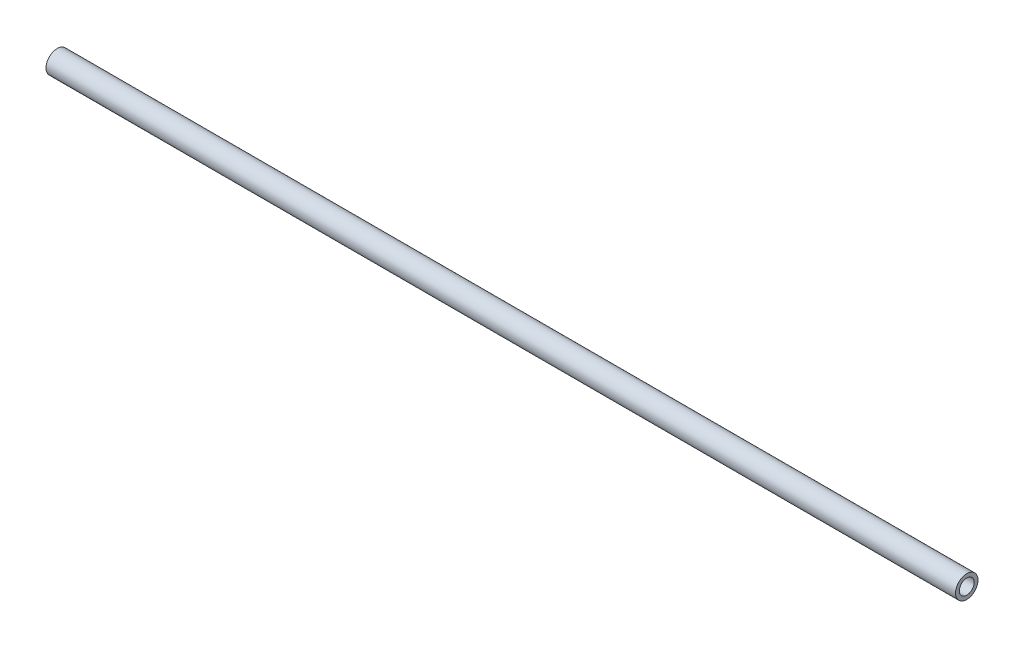
ISO-10303-21;
HEADER;
FILE_DESCRIPTION(('STEP AP214'),'2;1');
FILE_NAME('part.step','',(''),(''),'','','');
FILE_SCHEMA(('AUTOMOTIVE_DESIGN { 1 0 10303 214 1 1 1 1 }'));
ENDSEC;
DATA;
#1=APPLICATION_CONTEXT('core data for automotive mechanical design processes');
#2=APPLICATION_PROTOCOL_DEFINITION('international standard','automotive_design',2000,#1);
#3=PRODUCT_CONTEXT('',#1,'mechanical');
#4=PRODUCT('Part','Part','',(#3));
#5=PRODUCT_RELATED_PRODUCT_CATEGORY('part','',(#4));
#6=PRODUCT_DEFINITION_FORMATION('','',#4);
#7=PRODUCT_DEFINITION_CONTEXT('part definition',#1,'design');
#8=PRODUCT_DEFINITION('design','',#6,#7);
#9=PRODUCT_DEFINITION_SHAPE('','',#8);
#10=(LENGTH_UNIT() NAMED_UNIT(*) SI_UNIT(.MILLI.,.METRE.));
#11=(NAMED_UNIT(*) PLANE_ANGLE_UNIT() SI_UNIT($,.RADIAN.));
#12=(NAMED_UNIT(*) SI_UNIT($,.STERADIAN.) SOLID_ANGLE_UNIT());
#13=UNCERTAINTY_MEASURE_WITH_UNIT(LENGTH_MEASURE(1.E-05),#10,'distance_accuracy_value','');
#14=(GEOMETRIC_REPRESENTATION_CONTEXT(3) GLOBAL_UNCERTAINTY_ASSIGNED_CONTEXT((#13)) GLOBAL_UNIT_ASSIGNED_CONTEXT((#10,
#11,#12)) REPRESENTATION_CONTEXT('',''));
#15=CARTESIAN_POINT('',(0.,0.,0.));
#16=DIRECTION('',(0.,0.,1.));
#17=DIRECTION('',(1.,0.,0.));
#18=AXIS2_PLACEMENT_3D('',#15,#16,#17);
#19=CARTESIAN_POINT('',(-82.,0.,0.));
#20=DIRECTION('',(1.,0.,0.));
#21=DIRECTION('',(0.,0.,-1.));
#22=AXIS2_PLACEMENT_3D('',#19,#20,#21);
#23=PLANE('',#22);
#24=CARTESIAN_POINT('',(-82.,0.,0.));
#25=DIRECTION('',(1.,0.,0.));
#26=DIRECTION('',(0.,0.,-1.));
#27=AXIS2_PLACEMENT_3D('',#24,#25,#26);
#28=CIRCLE('',#27,0.979);
#29=CARTESIAN_POINT('',(-82.,0.,-0.979));
#30=VERTEX_POINT('',#29);
#31=EDGE_CURVE('P0_E18',#30,#30,#28,.T.);
#32=ORIENTED_EDGE('',*,*,#31,.F.);
#33=EDGE_LOOP('',(#32));
#34=FACE_BOUND('',#33,.T.);
#35=ADVANCED_FACE('P0_F15',(#34),#23,.F.);
#36=CARTESIAN_POINT('',(-2.,0.,0.));
#37=DIRECTION('',(1.,0.,0.));
#38=DIRECTION('',(0.,0.,-1.));
#39=AXIS2_PLACEMENT_3D('',#36,#37,#38);
#40=PLANE('',#39);
#41=CARTESIAN_POINT('',(-2.,0.,0.));
#42=DIRECTION('',(1.,0.,0.));
#43=DIRECTION('',(0.,0.,-1.));
#44=AXIS2_PLACEMENT_3D('',#41,#42,#43);
#45=CIRCLE('',#44,0.979);
#46=CARTESIAN_POINT('',(-2.,0.,-0.979));
#47=VERTEX_POINT('',#46);
#48=EDGE_CURVE('P0_E10',#47,#47,#45,.F.);
#49=ORIENTED_EDGE('',*,*,#48,.F.);
#50=EDGE_LOOP('',(#49));
#51=FACE_BOUND('',#50,.T.);
#52=ADVANCED_FACE('P0_F30',(#51),#40,.T.);
#53=CARTESIAN_POINT('',(-82.,0.,0.));
#54=DIRECTION('',(1.,0.,0.));
#55=DIRECTION('',(0.,0.,-1.));
#56=AXIS2_PLACEMENT_3D('',#53,#54,#55);
#57=CYLINDRICAL_SURFACE('',#56,0.979);
#58=ORIENTED_EDGE('',*,*,#48,.T.);
#59=EDGE_LOOP('',(#58));
#60=FACE_BOUND('',#59,.T.);
#61=ORIENTED_EDGE('',*,*,#31,.T.);
#62=EDGE_LOOP('',(#61));
#63=FACE_BOUND('',#62,.T.);
#64=ADVANCED_FACE('P0_F27',(#60,#63),#57,.T.);
#65=CLOSED_SHELL('',(#35,#52,#64));
#66=MANIFOLD_SOLID_BREP('P0_B1',#65);
#67=CARTESIAN_POINT('',(-120.,0.,0.));
#68=DIRECTION('',(1.,0.,0.));
#69=DIRECTION('',(0.,0.,-1.));
#70=AXIS2_PLACEMENT_3D('',#67,#68,#69);
#71=CYLINDRICAL_SURFACE('',#70,0.98);
#72=CARTESIAN_POINT('',(0.,0.,0.));
#73=DIRECTION('',(1.,0.,0.));
#74=DIRECTION('',(0.,0.,-1.));
#75=AXIS2_PLACEMENT_3D('',#72,#73,#74);
#76=CIRCLE('',#75,0.98);
#77=CARTESIAN_POINT('',(0.,0.,-0.98));
#78=VERTEX_POINT('',#77);
#79=EDGE_CURVE('P1_E27',#78,#78,#76,.F.);
#80=ORIENTED_EDGE('',*,*,#79,.F.);
#81=EDGE_LOOP('',(#80));
#82=FACE_BOUND('',#81,.T.);
#83=CARTESIAN_POINT('',(-120.,0.,0.));
#84=DIRECTION('',(1.,0.,0.));
#85=DIRECTION('',(0.,0.,-1.));
#86=AXIS2_PLACEMENT_3D('',#83,#84,#85);
#87=CIRCLE('',#86,0.98);
#88=CARTESIAN_POINT('',(-120.,0.,-0.98));
#89=VERTEX_POINT('',#88);
#90=EDGE_CURVE('P1_E18',#89,#89,#87,.F.);
#91=ORIENTED_EDGE('',*,*,#90,.T.);
#92=EDGE_LOOP('',(#91));
#93=FACE_BOUND('',#92,.T.);
#94=ADVANCED_FACE('P1_F15',(#82,#93),#71,.F.);
#95=CARTESIAN_POINT('',(-120.,0.,0.));
#96=DIRECTION('',(1.,0.,0.));
#97=DIRECTION('',(0.,0.,-1.));
#98=AXIS2_PLACEMENT_3D('',#95,#96,#97);
#99=PLANE('',#98);
#100=CARTESIAN_POINT('',(-120.,0.,0.));
#101=DIRECTION('',(1.,0.,0.));
#102=DIRECTION('',(0.,0.,-1.));
#103=AXIS2_PLACEMENT_3D('',#100,#101,#102);
#104=CIRCLE('',#103,1.48);
#105=CARTESIAN_POINT('',(-120.,0.,-1.48));
#106=VERTEX_POINT('',#105);
#107=EDGE_CURVE('P1_E22',#106,#106,#104,.T.);
#108=ORIENTED_EDGE('',*,*,#107,.F.);
#109=EDGE_LOOP('',(#108));
#110=FACE_BOUND('',#109,.T.);
#111=ORIENTED_EDGE('',*,*,#90,.F.);
#112=EDGE_LOOP('',(#111));
#113=FACE_BOUND('',#112,.T.);
#114=ADVANCED_FACE('P1_F36',(#110,#113),#99,.F.);
#115=CARTESIAN_POINT('',(0.,0.,0.));
#116=DIRECTION('',(1.,0.,0.));
#117=DIRECTION('',(0.,0.,-1.));
#118=AXIS2_PLACEMENT_3D('',#115,#116,#117);
#119=PLANE('',#118);
#120=CARTESIAN_POINT('',(0.,0.,0.));
#121=DIRECTION('',(1.,0.,0.));
#122=DIRECTION('',(0.,0.,-1.));
#123=AXIS2_PLACEMENT_3D('',#120,#121,#122);
#124=CIRCLE('',#123,1.48);
#125=CARTESIAN_POINT('',(0.,0.,-1.48));
#126=VERTEX_POINT('',#125);
#127=EDGE_CURVE('P1_E10',#126,#126,#124,.F.);
#128=ORIENTED_EDGE('',*,*,#127,.F.);
#129=EDGE_LOOP('',(#128));
#130=FACE_BOUND('',#129,.T.);
#131=ORIENTED_EDGE('',*,*,#79,.T.);
#132=EDGE_LOOP('',(#131));
#133=FACE_BOUND('',#132,.T.);
#134=ADVANCED_FACE('P1_F38',(#130,#133),#119,.T.);
#135=CARTESIAN_POINT('',(-120.,0.,0.));
#136=DIRECTION('',(1.,0.,0.));
#137=DIRECTION('',(0.,0.,-1.));
#138=AXIS2_PLACEMENT_3D('',#135,#136,#137);
#139=CYLINDRICAL_SURFACE('',#138,1.48);
#140=ORIENTED_EDGE('',*,*,#127,.T.);
#141=EDGE_LOOP('',(#140));
#142=FACE_BOUND('',#141,.T.);
#143=ORIENTED_EDGE('',*,*,#107,.T.);
#144=EDGE_LOOP('',(#143));
#145=FACE_BOUND('',#144,.T.);
#146=ADVANCED_FACE('P1_F45',(#142,#145),#139,.T.);
#147=CLOSED_SHELL('',(#94,#114,#134,#146));
#148=MANIFOLD_SOLID_BREP('P1_B1',#147);
#149=ADVANCED_BREP_SHAPE_REPRESENTATION('',(#18,#66,#148),#14);
#150=SHAPE_DEFINITION_REPRESENTATION(#9,#149);
ENDSEC;
END-ISO-10303-21;
